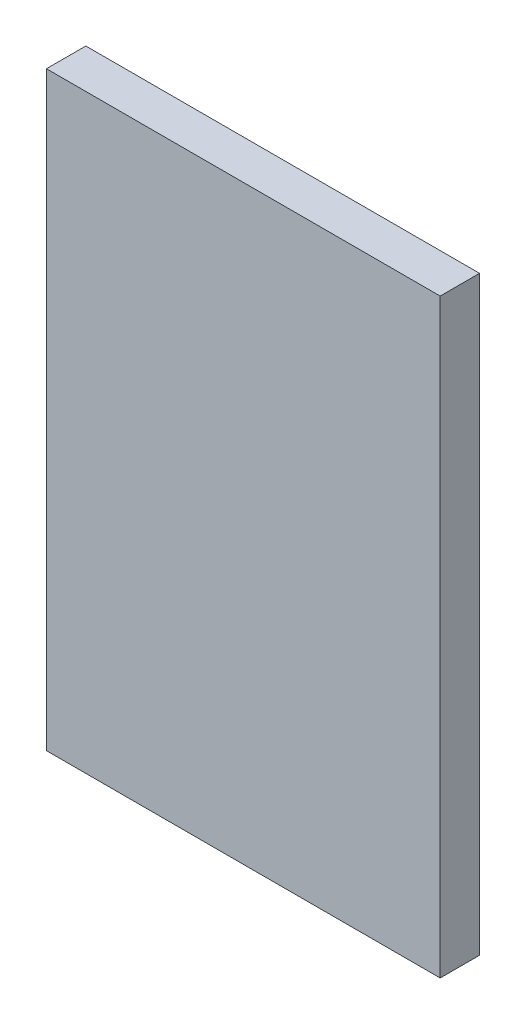
ISO-10303-21;
HEADER;
FILE_DESCRIPTION(('STEP AP214'),'2;1');
FILE_NAME('part.step','',(''),(''),'','','');
FILE_SCHEMA(('AUTOMOTIVE_DESIGN { 1 0 10303 214 1 1 1 1 }'));
ENDSEC;
DATA;
#1=APPLICATION_CONTEXT('core data for automotive mechanical design processes');
#2=APPLICATION_PROTOCOL_DEFINITION('international standard','automotive_design',2000,#1);
#3=PRODUCT_CONTEXT('',#1,'mechanical');
#4=PRODUCT('Part','Part','',(#3));
#5=PRODUCT_RELATED_PRODUCT_CATEGORY('part','',(#4));
#6=PRODUCT_DEFINITION_FORMATION('','',#4);
#7=PRODUCT_DEFINITION_CONTEXT('part definition',#1,'design');
#8=PRODUCT_DEFINITION('design','',#6,#7);
#9=PRODUCT_DEFINITION_SHAPE('','',#8);
#10=(LENGTH_UNIT() NAMED_UNIT(*) SI_UNIT(.MILLI.,.METRE.));
#11=(NAMED_UNIT(*) PLANE_ANGLE_UNIT() SI_UNIT($,.RADIAN.));
#12=(NAMED_UNIT(*) SI_UNIT($,.STERADIAN.) SOLID_ANGLE_UNIT());
#13=UNCERTAINTY_MEASURE_WITH_UNIT(LENGTH_MEASURE(1.E-05),#10,'distance_accuracy_value','');
#14=(GEOMETRIC_REPRESENTATION_CONTEXT(3) GLOBAL_UNCERTAINTY_ASSIGNED_CONTEXT((#13)) GLOBAL_UNIT_ASSIGNED_CONTEXT((#10,
#11,#12)) REPRESENTATION_CONTEXT('',''));
#15=CARTESIAN_POINT('',(0.,0.,0.));
#16=DIRECTION('',(0.,0.,1.));
#17=DIRECTION('',(1.,0.,0.));
#18=AXIS2_PLACEMENT_3D('',#15,#16,#17);
#19=CARTESIAN_POINT('',(0.,0.,2.));
#20=DIRECTION('',(1.,0.,0.));
#21=DIRECTION('',(0.,0.,-1.));
#22=AXIS2_PLACEMENT_3D('',#19,#20,#21);
#23=PLANE('',#22);
#24=DIRECTION('',(0.,-1.,0.));
#25=VECTOR('',#24,1.);
#26=CARTESIAN_POINT('',(0.,0.,0.));
#27=LINE('',#26,#25);
#28=CARTESIAN_POINT('',(0.,30.,0.));
#29=VERTEX_POINT('',#28);
#30=CARTESIAN_POINT('',(0.,0.,0.));
#31=VERTEX_POINT('',#30);
#32=EDGE_CURVE('E96',#29,#31,#27,.T.);
#33=ORIENTED_EDGE('',*,*,#32,.T.);
#34=DIRECTION('',(0.,0.,-1.));
#35=VECTOR('',#34,1.);
#36=CARTESIAN_POINT('',(0.,0.,2.));
#37=LINE('',#36,#35);
#38=CARTESIAN_POINT('',(0.,0.,2.));
#39=VERTEX_POINT('',#38);
#40=EDGE_CURVE('E11',#39,#31,#37,.T.);
#41=ORIENTED_EDGE('',*,*,#40,.F.);
#42=DIRECTION('',(0.,-1.,0.));
#43=VECTOR('',#42,1.);
#44=CARTESIAN_POINT('',(0.,0.,2.));
#45=LINE('',#44,#43);
#46=CARTESIAN_POINT('',(0.,30.,2.));
#47=VERTEX_POINT('',#46);
#48=EDGE_CURVE('E84',#47,#39,#45,.T.);
#49=ORIENTED_EDGE('',*,*,#48,.F.);
#50=DIRECTION('',(0.,0.,-1.));
#51=VECTOR('',#50,1.);
#52=CARTESIAN_POINT('',(0.,30.,2.));
#53=LINE('',#52,#51);
#54=EDGE_CURVE('E92',#47,#29,#53,.T.);
#55=ORIENTED_EDGE('',*,*,#54,.T.);
#56=EDGE_LOOP('',(#33,#41,#49,#55));
#57=FACE_BOUND('',#56,.T.);
#58=ADVANCED_FACE('F33',(#57),#23,.F.);
#59=CARTESIAN_POINT('',(0.,0.,2.));
#60=DIRECTION('',(0.,1.,0.));
#61=DIRECTION('',(0.,0.,1.));
#62=AXIS2_PLACEMENT_3D('',#59,#60,#61);
#63=PLANE('',#62);
#64=DIRECTION('',(1.,0.,0.));
#65=VECTOR('',#64,1.);
#66=CARTESIAN_POINT('',(0.,0.,0.));
#67=LINE('',#66,#65);
#68=CARTESIAN_POINT('',(20.,0.,0.));
#69=VERTEX_POINT('',#68);
#70=EDGE_CURVE('E88',#31,#69,#67,.T.);
#71=ORIENTED_EDGE('',*,*,#70,.T.);
#72=DIRECTION('',(0.,0.,-1.));
#73=VECTOR('',#72,1.);
#74=CARTESIAN_POINT('',(20.,0.,2.));
#75=LINE('',#74,#73);
#76=CARTESIAN_POINT('',(20.,0.,2.));
#77=VERTEX_POINT('',#76);
#78=EDGE_CURVE('E41',#77,#69,#75,.T.);
#79=ORIENTED_EDGE('',*,*,#78,.F.);
#80=DIRECTION('',(1.,0.,0.));
#81=VECTOR('',#80,1.);
#82=CARTESIAN_POINT('',(0.,0.,2.));
#83=LINE('',#82,#81);
#84=EDGE_CURVE('E79',#39,#77,#83,.T.);
#85=ORIENTED_EDGE('',*,*,#84,.F.);
#86=ORIENTED_EDGE('',*,*,#40,.T.);
#87=EDGE_LOOP('',(#71,#79,#85,#86));
#88=FACE_BOUND('',#87,.T.);
#89=ADVANCED_FACE('F87',(#88),#63,.F.);
#90=CARTESIAN_POINT('',(20.,0.,2.));
#91=DIRECTION('',(-1.,0.,0.));
#92=DIRECTION('',(0.,0.,1.));
#93=AXIS2_PLACEMENT_3D('',#90,#91,#92);
#94=PLANE('',#93);
#95=DIRECTION('',(0.,1.,0.));
#96=VECTOR('',#95,1.);
#97=CARTESIAN_POINT('',(20.,0.,0.));
#98=LINE('',#97,#96);
#99=CARTESIAN_POINT('',(20.,30.,0.));
#100=VERTEX_POINT('',#99);
#101=EDGE_CURVE('E66',#69,#100,#98,.T.);
#102=ORIENTED_EDGE('',*,*,#101,.T.);
#103=DIRECTION('',(0.,0.,-1.));
#104=VECTOR('',#103,1.);
#105=CARTESIAN_POINT('',(20.,30.,2.));
#106=LINE('',#105,#104);
#107=CARTESIAN_POINT('',(20.,30.,2.));
#108=VERTEX_POINT('',#107);
#109=EDGE_CURVE('E89',#108,#100,#106,.T.);
#110=ORIENTED_EDGE('',*,*,#109,.F.);
#111=DIRECTION('',(0.,1.,0.));
#112=VECTOR('',#111,1.);
#113=CARTESIAN_POINT('',(20.,0.,2.));
#114=LINE('',#113,#112);
#115=EDGE_CURVE('E82',#77,#108,#114,.T.);
#116=ORIENTED_EDGE('',*,*,#115,.F.);
#117=ORIENTED_EDGE('',*,*,#78,.T.);
#118=EDGE_LOOP('',(#102,#110,#116,#117));
#119=FACE_BOUND('',#118,.T.);
#120=ADVANCED_FACE('F90',(#119),#94,.F.);
#121=CARTESIAN_POINT('',(0.,30.,2.));
#122=DIRECTION('',(0.,-1.,0.));
#123=DIRECTION('',(0.,0.,-1.));
#124=AXIS2_PLACEMENT_3D('',#121,#122,#123);
#125=PLANE('',#124);
#126=DIRECTION('',(-1.,0.,0.));
#127=VECTOR('',#126,1.);
#128=CARTESIAN_POINT('',(0.,30.,0.));
#129=LINE('',#128,#127);
#130=EDGE_CURVE('E72',#100,#29,#129,.T.);
#131=ORIENTED_EDGE('',*,*,#130,.T.);
#132=ORIENTED_EDGE('',*,*,#54,.F.);
#133=DIRECTION('',(-1.,0.,0.));
#134=VECTOR('',#133,1.);
#135=CARTESIAN_POINT('',(0.,30.,2.));
#136=LINE('',#135,#134);
#137=EDGE_CURVE('E49',#108,#47,#136,.T.);
#138=ORIENTED_EDGE('',*,*,#137,.F.);
#139=ORIENTED_EDGE('',*,*,#109,.T.);
#140=EDGE_LOOP('',(#131,#132,#138,#139));
#141=FACE_BOUND('',#140,.T.);
#142=ADVANCED_FACE('F103',(#141),#125,.F.);
#143=CARTESIAN_POINT('',(0.,0.,2.));
#144=DIRECTION('',(0.,0.,-1.));
#145=DIRECTION('',(-1.,0.,0.));
#146=AXIS2_PLACEMENT_3D('',#143,#144,#145);
#147=PLANE('',#146);
#148=ORIENTED_EDGE('',*,*,#48,.T.);
#149=ORIENTED_EDGE('',*,*,#84,.T.);
#150=ORIENTED_EDGE('',*,*,#115,.T.);
#151=ORIENTED_EDGE('',*,*,#137,.T.);
#152=EDGE_LOOP('',(#148,#149,#150,#151));
#153=FACE_BOUND('',#152,.T.);
#154=ADVANCED_FACE('F80',(#153),#147,.F.);
#155=CARTESIAN_POINT('',(0.,0.,0.));
#156=DIRECTION('',(0.,0.,-1.));
#157=DIRECTION('',(-1.,0.,0.));
#158=AXIS2_PLACEMENT_3D('',#155,#156,#157);
#159=PLANE('',#158);
#160=ORIENTED_EDGE('',*,*,#32,.F.);
#161=ORIENTED_EDGE('',*,*,#130,.F.);
#162=ORIENTED_EDGE('',*,*,#101,.F.);
#163=ORIENTED_EDGE('',*,*,#70,.F.);
#164=EDGE_LOOP('',(#160,#161,#162,#163));
#165=FACE_BOUND('',#164,.T.);
#166=ADVANCED_FACE('F106',(#165),#159,.T.);
#167=CLOSED_SHELL('',(#58,#89,#120,#142,#154,#166));
#168=MANIFOLD_SOLID_BREP('B2',#167);
#169=ADVANCED_BREP_SHAPE_REPRESENTATION('',(#18,#168),#14);
#170=SHAPE_DEFINITION_REPRESENTATION(#9,#169);
ENDSEC;
END-ISO-10303-21;
